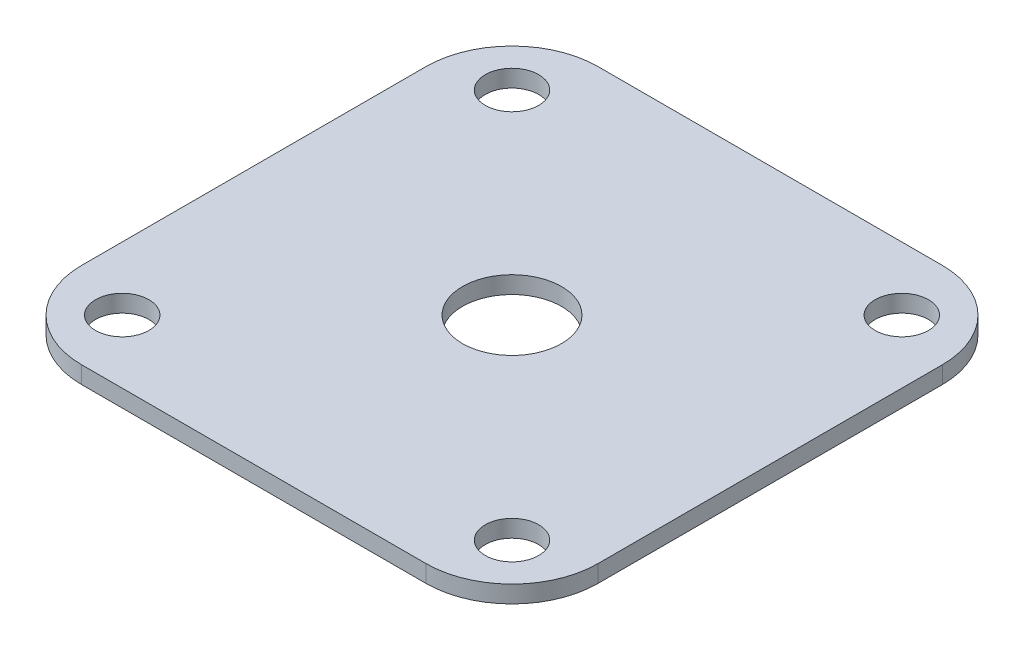
ISO-10303-21;
HEADER;
FILE_DESCRIPTION(('STEP AP214'),'2;1');
FILE_NAME('part.step','',(''),(''),'','','');
FILE_SCHEMA(('AUTOMOTIVE_DESIGN { 1 0 10303 214 1 1 1 1 }'));
ENDSEC;
DATA;
#1=APPLICATION_CONTEXT('core data for automotive mechanical design processes');
#2=APPLICATION_PROTOCOL_DEFINITION('international standard','automotive_design',2000,#1);
#3=PRODUCT_CONTEXT('',#1,'mechanical');
#4=PRODUCT('Part','Part','',(#3));
#5=PRODUCT_RELATED_PRODUCT_CATEGORY('part','',(#4));
#6=PRODUCT_DEFINITION_FORMATION('','',#4);
#7=PRODUCT_DEFINITION_CONTEXT('part definition',#1,'design');
#8=PRODUCT_DEFINITION('design','',#6,#7);
#9=PRODUCT_DEFINITION_SHAPE('','',#8);
#10=(LENGTH_UNIT() NAMED_UNIT(*) SI_UNIT(.MILLI.,.METRE.));
#11=(NAMED_UNIT(*) PLANE_ANGLE_UNIT() SI_UNIT($,.RADIAN.));
#12=(NAMED_UNIT(*) SI_UNIT($,.STERADIAN.) SOLID_ANGLE_UNIT());
#13=UNCERTAINTY_MEASURE_WITH_UNIT(LENGTH_MEASURE(1.E-05),#10,'distance_accuracy_value','');
#14=(GEOMETRIC_REPRESENTATION_CONTEXT(3) GLOBAL_UNCERTAINTY_ASSIGNED_CONTEXT((#13)) GLOBAL_UNIT_ASSIGNED_CONTEXT((#10,
#11,#12)) REPRESENTATION_CONTEXT('',''));
#15=CARTESIAN_POINT('',(0.,0.,0.));
#16=DIRECTION('',(0.,0.,1.));
#17=DIRECTION('',(1.,0.,0.));
#18=AXIS2_PLACEMENT_3D('',#15,#16,#17);
#19=CARTESIAN_POINT('',(20.,2.,20.));
#20=DIRECTION('',(0.,1.,0.));
#21=DIRECTION('',(0.,0.,1.));
#22=AXIS2_PLACEMENT_3D('',#19,#20,#21);
#23=PLANE('',#22);
#24=CARTESIAN_POINT('',(0.,2.,0.));
#25=DIRECTION('',(0.,1.,0.));
#26=DIRECTION('',(0.,0.,1.));
#27=AXIS2_PLACEMENT_3D('',#24,#25,#26);
#28=CIRCLE('',#27,5.75);
#29=CARTESIAN_POINT('',(0.,2.,5.75));
#30=VERTEX_POINT('',#29);
#31=EDGE_CURVE('E203',#30,#30,#28,.T.);
#32=ORIENTED_EDGE('',*,*,#31,.F.);
#33=EDGE_LOOP('',(#32));
#34=FACE_BOUND('',#33,.T.);
#35=CARTESIAN_POINT('',(22.6442307692308,2.,22.6442307692308));
#36=DIRECTION('',(0.,1.,0.));
#37=DIRECTION('',(0.,0.,1.));
#38=AXIS2_PLACEMENT_3D('',#35,#36,#37);
#39=CIRCLE('',#38,3.1);
#40=CARTESIAN_POINT('',(22.6442307692308,2.,25.7442307692308));
#41=VERTEX_POINT('',#40);
#42=EDGE_CURVE('E188',#41,#41,#39,.T.);
#43=ORIENTED_EDGE('',*,*,#42,.F.);
#44=EDGE_LOOP('',(#43));
#45=FACE_BOUND('',#44,.T.);
#46=CARTESIAN_POINT('',(-22.6442307692308,2.,-22.6442307692308));
#47=DIRECTION('',(0.,1.,0.));
#48=DIRECTION('',(0.,0.,1.));
#49=AXIS2_PLACEMENT_3D('',#46,#47,#48);
#50=CIRCLE('',#49,3.1);
#51=CARTESIAN_POINT('',(-22.6442307692308,2.,-19.5442307692308));
#52=VERTEX_POINT('',#51);
#53=EDGE_CURVE('E134',#52,#52,#50,.T.);
#54=ORIENTED_EDGE('',*,*,#53,.F.);
#55=EDGE_LOOP('',(#54));
#56=FACE_BOUND('',#55,.T.);
#57=CARTESIAN_POINT('',(20.,2.,20.));
#58=DIRECTION('',(0.,1.,0.));
#59=DIRECTION('',(0.,0.,1.));
#60=AXIS2_PLACEMENT_3D('',#57,#58,#59);
#61=CIRCLE('',#60,10.);
#62=CARTESIAN_POINT('',(19.9999999999999,2.,30.));
#63=VERTEX_POINT('',#62);
#64=CARTESIAN_POINT('',(30.,2.,19.9999999999999));
#65=VERTEX_POINT('',#64);
#66=EDGE_CURVE('E145',#63,#65,#61,.T.);
#67=ORIENTED_EDGE('',*,*,#66,.T.);
#68=DIRECTION('',(0.,0.,-1.));
#69=VECTOR('',#68,1.);
#70=CARTESIAN_POINT('',(30.,2.,19.9999999999999));
#71=LINE('',#70,#69);
#72=CARTESIAN_POINT('',(30.,2.,-19.9999999999999));
#73=VERTEX_POINT('',#72);
#74=EDGE_CURVE('E93',#65,#73,#71,.T.);
#75=ORIENTED_EDGE('',*,*,#74,.T.);
#76=CARTESIAN_POINT('',(20.,2.,-20.));
#77=DIRECTION('',(0.,1.,0.));
#78=DIRECTION('',(0.,0.,-1.));
#79=AXIS2_PLACEMENT_3D('',#76,#77,#78);
#80=CIRCLE('',#79,10.);
#81=CARTESIAN_POINT('',(19.9999999999999,2.,-30.));
#82=VERTEX_POINT('',#81);
#83=EDGE_CURVE('E160',#73,#82,#80,.T.);
#84=ORIENTED_EDGE('',*,*,#83,.T.);
#85=DIRECTION('',(-1.,0.,0.));
#86=VECTOR('',#85,1.);
#87=CARTESIAN_POINT('',(-19.9999999999999,2.,-30.));
#88=LINE('',#87,#86);
#89=CARTESIAN_POINT('',(-20.,2.,-30.));
#90=VERTEX_POINT('',#89);
#91=EDGE_CURVE('E173',#82,#90,#88,.T.);
#92=ORIENTED_EDGE('',*,*,#91,.T.);
#93=CARTESIAN_POINT('',(-20.,2.,-20.));
#94=DIRECTION('',(0.,1.,0.));
#95=DIRECTION('',(0.,0.,-1.));
#96=AXIS2_PLACEMENT_3D('',#93,#94,#95);
#97=CIRCLE('',#96,10.);
#98=CARTESIAN_POINT('',(-30.,2.,-19.9999999999999));
#99=VERTEX_POINT('',#98);
#100=EDGE_CURVE('E112',#90,#99,#97,.T.);
#101=ORIENTED_EDGE('',*,*,#100,.T.);
#102=DIRECTION('',(0.,0.,1.));
#103=VECTOR('',#102,1.);
#104=CARTESIAN_POINT('',(-30.,2.,19.9999999999999));
#105=LINE('',#104,#103);
#106=CARTESIAN_POINT('',(-30.,2.,19.9999999999999));
#107=VERTEX_POINT('',#106);
#108=EDGE_CURVE('E106',#99,#107,#105,.T.);
#109=ORIENTED_EDGE('',*,*,#108,.T.);
#110=CARTESIAN_POINT('',(-20.,2.,20.));
#111=DIRECTION('',(0.,1.,0.));
#112=DIRECTION('',(0.,0.,-1.));
#113=AXIS2_PLACEMENT_3D('',#110,#111,#112);
#114=CIRCLE('',#113,10.);
#115=CARTESIAN_POINT('',(-19.9999999999999,2.,30.));
#116=VERTEX_POINT('',#115);
#117=EDGE_CURVE('E110',#107,#116,#114,.T.);
#118=ORIENTED_EDGE('',*,*,#117,.T.);
#119=DIRECTION('',(1.,0.,0.));
#120=VECTOR('',#119,1.);
#121=CARTESIAN_POINT('',(-19.9999999999999,2.,30.));
#122=LINE('',#121,#120);
#123=EDGE_CURVE('E50',#116,#63,#122,.T.);
#124=ORIENTED_EDGE('',*,*,#123,.T.);
#125=EDGE_LOOP('',(#67,#75,#84,#92,#101,#109,#118,#124));
#126=FACE_BOUND('',#125,.T.);
#127=CARTESIAN_POINT('',(-22.6442307692308,2.,22.6442307692308));
#128=DIRECTION('',(0.,1.,0.));
#129=DIRECTION('',(0.,0.,1.));
#130=AXIS2_PLACEMENT_3D('',#127,#128,#129);
#131=CIRCLE('',#130,3.1);
#132=CARTESIAN_POINT('',(-22.6442307692308,2.,25.7442307692308));
#133=VERTEX_POINT('',#132);
#134=EDGE_CURVE('E182',#133,#133,#131,.T.);
#135=ORIENTED_EDGE('',*,*,#134,.F.);
#136=EDGE_LOOP('',(#135));
#137=FACE_BOUND('',#136,.T.);
#138=CARTESIAN_POINT('',(22.6442307692308,2.,-22.6442307692307));
#139=DIRECTION('',(0.,1.,0.));
#140=DIRECTION('',(0.,0.,1.));
#141=AXIS2_PLACEMENT_3D('',#138,#139,#140);
#142=CIRCLE('',#141,3.1);
#143=CARTESIAN_POINT('',(22.6442307692308,2.,-19.5442307692308));
#144=VERTEX_POINT('',#143);
#145=EDGE_CURVE('E194',#144,#144,#142,.T.);
#146=ORIENTED_EDGE('',*,*,#145,.F.);
#147=EDGE_LOOP('',(#146));
#148=FACE_BOUND('',#147,.T.);
#149=ADVANCED_FACE('F33',(#34,#45,#56,#126,#137,#148),#23,.T.);
#150=CARTESIAN_POINT('',(20.,0.,20.));
#151=DIRECTION('',(0.,1.,0.));
#152=DIRECTION('',(0.,0.,1.));
#153=AXIS2_PLACEMENT_3D('',#150,#151,#152);
#154=PLANE('',#153);
#155=CARTESIAN_POINT('',(0.,0.,0.));
#156=DIRECTION('',(0.,1.,0.));
#157=DIRECTION('',(0.,0.,1.));
#158=AXIS2_PLACEMENT_3D('',#155,#156,#157);
#159=CIRCLE('',#158,5.75);
#160=CARTESIAN_POINT('',(0.,0.,5.75));
#161=VERTEX_POINT('',#160);
#162=EDGE_CURVE('E200',#161,#161,#159,.T.);
#163=ORIENTED_EDGE('',*,*,#162,.T.);
#164=EDGE_LOOP('',(#163));
#165=FACE_BOUND('',#164,.T.);
#166=CARTESIAN_POINT('',(20.,0.,20.));
#167=DIRECTION('',(0.,1.,0.));
#168=DIRECTION('',(0.,0.,1.));
#169=AXIS2_PLACEMENT_3D('',#166,#167,#168);
#170=CIRCLE('',#169,10.);
#171=CARTESIAN_POINT('',(19.9999999999999,0.,30.));
#172=VERTEX_POINT('',#171);
#173=CARTESIAN_POINT('',(30.,0.,19.9999999999999));
#174=VERTEX_POINT('',#173);
#175=EDGE_CURVE('E130',#172,#174,#170,.T.);
#176=ORIENTED_EDGE('',*,*,#175,.F.);
#177=DIRECTION('',(1.,0.,0.));
#178=VECTOR('',#177,1.);
#179=CARTESIAN_POINT('',(-19.9999999999999,0.,30.));
#180=LINE('',#179,#178);
#181=CARTESIAN_POINT('',(-19.9999999999999,0.,30.));
#182=VERTEX_POINT('',#181);
#183=EDGE_CURVE('E85',#182,#172,#180,.T.);
#184=ORIENTED_EDGE('',*,*,#183,.F.);
#185=CARTESIAN_POINT('',(-20.,0.,20.));
#186=DIRECTION('',(0.,1.,0.));
#187=DIRECTION('',(0.,0.,-1.));
#188=AXIS2_PLACEMENT_3D('',#185,#186,#187);
#189=CIRCLE('',#188,10.);
#190=CARTESIAN_POINT('',(-30.,0.,19.9999999999999));
#191=VERTEX_POINT('',#190);
#192=EDGE_CURVE('E79',#191,#182,#189,.T.);
#193=ORIENTED_EDGE('',*,*,#192,.F.);
#194=DIRECTION('',(0.,0.,1.));
#195=VECTOR('',#194,1.);
#196=CARTESIAN_POINT('',(-30.,0.,19.9999999999999));
#197=LINE('',#196,#195);
#198=CARTESIAN_POINT('',(-30.,0.,-19.9999999999999));
#199=VERTEX_POINT('',#198);
#200=EDGE_CURVE('E120',#199,#191,#197,.T.);
#201=ORIENTED_EDGE('',*,*,#200,.F.);
#202=CARTESIAN_POINT('',(-20.,0.,-20.));
#203=DIRECTION('',(0.,1.,0.));
#204=DIRECTION('',(0.,0.,-1.));
#205=AXIS2_PLACEMENT_3D('',#202,#203,#204);
#206=CIRCLE('',#205,10.);
#207=CARTESIAN_POINT('',(-20.,0.,-30.));
#208=VERTEX_POINT('',#207);
#209=EDGE_CURVE('E140',#208,#199,#206,.T.);
#210=ORIENTED_EDGE('',*,*,#209,.F.);
#211=DIRECTION('',(-1.,0.,0.));
#212=VECTOR('',#211,1.);
#213=CARTESIAN_POINT('',(-19.9999999999999,0.,-30.));
#214=LINE('',#213,#212);
#215=CARTESIAN_POINT('',(19.9999999999999,0.,-30.));
#216=VERTEX_POINT('',#215);
#217=EDGE_CURVE('E138',#216,#208,#214,.T.);
#218=ORIENTED_EDGE('',*,*,#217,.F.);
#219=CARTESIAN_POINT('',(20.,0.,-20.));
#220=DIRECTION('',(0.,1.,0.));
#221=DIRECTION('',(0.,0.,-1.));
#222=AXIS2_PLACEMENT_3D('',#219,#220,#221);
#223=CIRCLE('',#222,10.);
#224=CARTESIAN_POINT('',(30.,0.,-19.9999999999999));
#225=VERTEX_POINT('',#224);
#226=EDGE_CURVE('E136',#225,#216,#223,.T.);
#227=ORIENTED_EDGE('',*,*,#226,.F.);
#228=DIRECTION('',(0.,0.,-1.));
#229=VECTOR('',#228,1.);
#230=CARTESIAN_POINT('',(30.,0.,19.9999999999999));
#231=LINE('',#230,#229);
#232=EDGE_CURVE('E133',#174,#225,#231,.T.);
#233=ORIENTED_EDGE('',*,*,#232,.F.);
#234=EDGE_LOOP('',(#176,#184,#193,#201,#210,#218,#227,#233));
#235=FACE_BOUND('',#234,.T.);
#236=CARTESIAN_POINT('',(-22.6442307692308,0.,-22.6442307692308));
#237=DIRECTION('',(0.,1.,0.));
#238=DIRECTION('',(0.,0.,1.));
#239=AXIS2_PLACEMENT_3D('',#236,#237,#238);
#240=CIRCLE('',#239,3.1);
#241=CARTESIAN_POINT('',(-22.6442307692308,0.,-19.5442307692308));
#242=VERTEX_POINT('',#241);
#243=EDGE_CURVE('E179',#242,#242,#240,.T.);
#244=ORIENTED_EDGE('',*,*,#243,.T.);
#245=EDGE_LOOP('',(#244));
#246=FACE_BOUND('',#245,.T.);
#247=CARTESIAN_POINT('',(-22.6442307692308,0.,22.6442307692308));
#248=DIRECTION('',(0.,1.,0.));
#249=DIRECTION('',(0.,0.,1.));
#250=AXIS2_PLACEMENT_3D('',#247,#248,#249);
#251=CIRCLE('',#250,3.1);
#252=CARTESIAN_POINT('',(-22.6442307692308,0.,25.7442307692308));
#253=VERTEX_POINT('',#252);
#254=EDGE_CURVE('E185',#253,#253,#251,.T.);
#255=ORIENTED_EDGE('',*,*,#254,.T.);
#256=EDGE_LOOP('',(#255));
#257=FACE_BOUND('',#256,.T.);
#258=CARTESIAN_POINT('',(22.6442307692308,0.,22.6442307692308));
#259=DIRECTION('',(0.,1.,0.));
#260=DIRECTION('',(0.,0.,1.));
#261=AXIS2_PLACEMENT_3D('',#258,#259,#260);
#262=CIRCLE('',#261,3.1);
#263=CARTESIAN_POINT('',(22.6442307692308,0.,25.7442307692308));
#264=VERTEX_POINT('',#263);
#265=EDGE_CURVE('E191',#264,#264,#262,.T.);
#266=ORIENTED_EDGE('',*,*,#265,.T.);
#267=EDGE_LOOP('',(#266));
#268=FACE_BOUND('',#267,.T.);
#269=CARTESIAN_POINT('',(22.6442307692308,0.,-22.6442307692307));
#270=DIRECTION('',(0.,1.,0.));
#271=DIRECTION('',(0.,0.,1.));
#272=AXIS2_PLACEMENT_3D('',#269,#270,#271);
#273=CIRCLE('',#272,3.1);
#274=CARTESIAN_POINT('',(22.6442307692308,0.,-19.5442307692308));
#275=VERTEX_POINT('',#274);
#276=EDGE_CURVE('E197',#275,#275,#273,.T.);
#277=ORIENTED_EDGE('',*,*,#276,.T.);
#278=EDGE_LOOP('',(#277));
#279=FACE_BOUND('',#278,.T.);
#280=ADVANCED_FACE('F164',(#165,#235,#246,#257,#268,#279),#154,.F.);
#281=CARTESIAN_POINT('',(20.,2.,20.));
#282=DIRECTION('',(0.,-1.,0.));
#283=DIRECTION('',(0.,0.,-1.));
#284=AXIS2_PLACEMENT_3D('',#281,#282,#283);
#285=CYLINDRICAL_SURFACE('',#284,10.);
#286=ORIENTED_EDGE('',*,*,#175,.T.);
#287=DIRECTION('',(0.,-1.,0.));
#288=VECTOR('',#287,1.);
#289=CARTESIAN_POINT('',(30.,2.,19.9999999999999));
#290=LINE('',#289,#288);
#291=EDGE_CURVE('E11',#65,#174,#290,.T.);
#292=ORIENTED_EDGE('',*,*,#291,.F.);
#293=ORIENTED_EDGE('',*,*,#66,.F.);
#294=DIRECTION('',(0.,-1.,0.));
#295=VECTOR('',#294,1.);
#296=CARTESIAN_POINT('',(19.9999999999999,2.,30.));
#297=LINE('',#296,#295);
#298=EDGE_CURVE('E126',#63,#172,#297,.T.);
#299=ORIENTED_EDGE('',*,*,#298,.T.);
#300=EDGE_LOOP('',(#286,#292,#293,#299));
#301=FACE_BOUND('',#300,.T.);
#302=ADVANCED_FACE('F35',(#301),#285,.T.);
#303=CARTESIAN_POINT('',(30.,2.,19.9999999999999));
#304=DIRECTION('',(-1.,0.,0.));
#305=DIRECTION('',(0.,0.,1.));
#306=AXIS2_PLACEMENT_3D('',#303,#304,#305);
#307=PLANE('',#306);
#308=ORIENTED_EDGE('',*,*,#232,.T.);
#309=DIRECTION('',(0.,-1.,0.));
#310=VECTOR('',#309,1.);
#311=CARTESIAN_POINT('',(30.,2.,-19.9999999999999));
#312=LINE('',#311,#310);
#313=EDGE_CURVE('E42',#73,#225,#312,.T.);
#314=ORIENTED_EDGE('',*,*,#313,.F.);
#315=ORIENTED_EDGE('',*,*,#74,.F.);
#316=ORIENTED_EDGE('',*,*,#291,.T.);
#317=EDGE_LOOP('',(#308,#314,#315,#316));
#318=FACE_BOUND('',#317,.T.);
#319=ADVANCED_FACE('F264',(#318),#307,.F.);
#320=CARTESIAN_POINT('',(20.,2.,-20.));
#321=DIRECTION('',(0.,-1.,0.));
#322=DIRECTION('',(0.,0.,-1.));
#323=AXIS2_PLACEMENT_3D('',#320,#321,#322);
#324=CYLINDRICAL_SURFACE('',#323,10.);
#325=ORIENTED_EDGE('',*,*,#226,.T.);
#326=DIRECTION('',(0.,-1.,0.));
#327=VECTOR('',#326,1.);
#328=CARTESIAN_POINT('',(19.9999999999999,2.,-30.));
#329=LINE('',#328,#327);
#330=EDGE_CURVE('E152',#82,#216,#329,.T.);
#331=ORIENTED_EDGE('',*,*,#330,.F.);
#332=ORIENTED_EDGE('',*,*,#83,.F.);
#333=ORIENTED_EDGE('',*,*,#313,.T.);
#334=EDGE_LOOP('',(#325,#331,#332,#333));
#335=FACE_BOUND('',#334,.T.);
#336=ADVANCED_FACE('F158',(#335),#324,.T.);
#337=CARTESIAN_POINT('',(-19.9999999999999,2.,-30.));
#338=DIRECTION('',(0.,0.,1.));
#339=DIRECTION('',(1.,0.,0.));
#340=AXIS2_PLACEMENT_3D('',#337,#338,#339);
#341=PLANE('',#340);
#342=ORIENTED_EDGE('',*,*,#217,.T.);
#343=DIRECTION('',(0.,-1.,0.));
#344=VECTOR('',#343,1.);
#345=CARTESIAN_POINT('',(-20.,2.,-30.));
#346=LINE('',#345,#344);
#347=EDGE_CURVE('E149',#90,#208,#346,.T.);
#348=ORIENTED_EDGE('',*,*,#347,.F.);
#349=ORIENTED_EDGE('',*,*,#91,.F.);
#350=ORIENTED_EDGE('',*,*,#330,.T.);
#351=EDGE_LOOP('',(#342,#348,#349,#350));
#352=FACE_BOUND('',#351,.T.);
#353=ADVANCED_FACE('F169',(#352),#341,.F.);
#354=CARTESIAN_POINT('',(-20.,2.,-20.));
#355=DIRECTION('',(0.,-1.,0.));
#356=DIRECTION('',(0.,0.,-1.));
#357=AXIS2_PLACEMENT_3D('',#354,#355,#356);
#358=CYLINDRICAL_SURFACE('',#357,10.);
#359=ORIENTED_EDGE('',*,*,#209,.T.);
#360=DIRECTION('',(0.,-1.,0.));
#361=VECTOR('',#360,1.);
#362=CARTESIAN_POINT('',(-30.,2.,-19.9999999999999));
#363=LINE('',#362,#361);
#364=EDGE_CURVE('E121',#99,#199,#363,.T.);
#365=ORIENTED_EDGE('',*,*,#364,.F.);
#366=ORIENTED_EDGE('',*,*,#100,.F.);
#367=ORIENTED_EDGE('',*,*,#347,.T.);
#368=EDGE_LOOP('',(#359,#365,#366,#367));
#369=FACE_BOUND('',#368,.T.);
#370=ADVANCED_FACE('F172',(#369),#358,.T.);
#371=CARTESIAN_POINT('',(-30.,2.,19.9999999999999));
#372=DIRECTION('',(1.,0.,0.));
#373=DIRECTION('',(0.,0.,-1.));
#374=AXIS2_PLACEMENT_3D('',#371,#372,#373);
#375=PLANE('',#374);
#376=ORIENTED_EDGE('',*,*,#200,.T.);
#377=DIRECTION('',(0.,-1.,0.));
#378=VECTOR('',#377,1.);
#379=CARTESIAN_POINT('',(-30.,2.,19.9999999999999));
#380=LINE('',#379,#378);
#381=EDGE_CURVE('E117',#107,#191,#380,.T.);
#382=ORIENTED_EDGE('',*,*,#381,.F.);
#383=ORIENTED_EDGE('',*,*,#108,.F.);
#384=ORIENTED_EDGE('',*,*,#364,.T.);
#385=EDGE_LOOP('',(#376,#382,#383,#384));
#386=FACE_BOUND('',#385,.T.);
#387=ADVANCED_FACE('F118',(#386),#375,.F.);
#388=CARTESIAN_POINT('',(-20.,2.,20.));
#389=DIRECTION('',(0.,-1.,0.));
#390=DIRECTION('',(0.,0.,-1.));
#391=AXIS2_PLACEMENT_3D('',#388,#389,#390);
#392=CYLINDRICAL_SURFACE('',#391,10.);
#393=ORIENTED_EDGE('',*,*,#192,.T.);
#394=DIRECTION('',(0.,-1.,0.));
#395=VECTOR('',#394,1.);
#396=CARTESIAN_POINT('',(-19.9999999999999,2.,30.));
#397=LINE('',#396,#395);
#398=EDGE_CURVE('E122',#116,#182,#397,.T.);
#399=ORIENTED_EDGE('',*,*,#398,.F.);
#400=ORIENTED_EDGE('',*,*,#117,.F.);
#401=ORIENTED_EDGE('',*,*,#381,.T.);
#402=EDGE_LOOP('',(#393,#399,#400,#401));
#403=FACE_BOUND('',#402,.T.);
#404=ADVANCED_FACE('F124',(#403),#392,.T.);
#405=CARTESIAN_POINT('',(-19.9999999999999,2.,30.));
#406=DIRECTION('',(0.,0.,-1.));
#407=DIRECTION('',(-1.,0.,0.));
#408=AXIS2_PLACEMENT_3D('',#405,#406,#407);
#409=PLANE('',#408);
#410=ORIENTED_EDGE('',*,*,#183,.T.);
#411=ORIENTED_EDGE('',*,*,#298,.F.);
#412=ORIENTED_EDGE('',*,*,#123,.F.);
#413=ORIENTED_EDGE('',*,*,#398,.T.);
#414=EDGE_LOOP('',(#410,#411,#412,#413));
#415=FACE_BOUND('',#414,.T.);
#416=ADVANCED_FACE('F228',(#415),#409,.F.);
#417=CARTESIAN_POINT('',(-22.6442307692308,2.,-22.6442307692308));
#418=DIRECTION('',(0.,-1.,0.));
#419=DIRECTION('',(0.,0.,-1.));
#420=AXIS2_PLACEMENT_3D('',#417,#418,#419);
#421=CYLINDRICAL_SURFACE('',#420,3.1);
#422=ORIENTED_EDGE('',*,*,#53,.T.);
#423=EDGE_LOOP('',(#422));
#424=FACE_BOUND('',#423,.T.);
#425=ORIENTED_EDGE('',*,*,#243,.F.);
#426=EDGE_LOOP('',(#425));
#427=FACE_BOUND('',#426,.T.);
#428=ADVANCED_FACE('F224',(#424,#427),#421,.F.);
#429=CARTESIAN_POINT('',(-22.6442307692308,2.,22.6442307692308));
#430=DIRECTION('',(0.,-1.,0.));
#431=DIRECTION('',(0.,0.,-1.));
#432=AXIS2_PLACEMENT_3D('',#429,#430,#431);
#433=CYLINDRICAL_SURFACE('',#432,3.1);
#434=ORIENTED_EDGE('',*,*,#134,.T.);
#435=EDGE_LOOP('',(#434));
#436=FACE_BOUND('',#435,.T.);
#437=ORIENTED_EDGE('',*,*,#254,.F.);
#438=EDGE_LOOP('',(#437));
#439=FACE_BOUND('',#438,.T.);
#440=ADVANCED_FACE('F227',(#436,#439),#433,.F.);
#441=CARTESIAN_POINT('',(22.6442307692308,2.,22.6442307692308));
#442=DIRECTION('',(0.,-1.,0.));
#443=DIRECTION('',(0.,0.,-1.));
#444=AXIS2_PLACEMENT_3D('',#441,#442,#443);
#445=CYLINDRICAL_SURFACE('',#444,3.1);
#446=ORIENTED_EDGE('',*,*,#42,.T.);
#447=EDGE_LOOP('',(#446));
#448=FACE_BOUND('',#447,.T.);
#449=ORIENTED_EDGE('',*,*,#265,.F.);
#450=EDGE_LOOP('',(#449));
#451=FACE_BOUND('',#450,.T.);
#452=ADVANCED_FACE('F241',(#448,#451),#445,.F.);
#453=CARTESIAN_POINT('',(22.6442307692308,2.,-22.6442307692307));
#454=DIRECTION('',(0.,-1.,0.));
#455=DIRECTION('',(0.,0.,-1.));
#456=AXIS2_PLACEMENT_3D('',#453,#454,#455);
#457=CYLINDRICAL_SURFACE('',#456,3.1);
#458=ORIENTED_EDGE('',*,*,#145,.T.);
#459=EDGE_LOOP('',(#458));
#460=FACE_BOUND('',#459,.T.);
#461=ORIENTED_EDGE('',*,*,#276,.F.);
#462=EDGE_LOOP('',(#461));
#463=FACE_BOUND('',#462,.T.);
#464=ADVANCED_FACE('F213',(#460,#463),#457,.F.);
#465=CARTESIAN_POINT('',(0.,0.,0.));
#466=DIRECTION('',(0.,1.,0.));
#467=DIRECTION('',(0.,0.,1.));
#468=AXIS2_PLACEMENT_3D('',#465,#466,#467);
#469=CYLINDRICAL_SURFACE('',#468,5.75);
#470=ORIENTED_EDGE('',*,*,#162,.F.);
#471=EDGE_LOOP('',(#470));
#472=FACE_BOUND('',#471,.T.);
#473=ORIENTED_EDGE('',*,*,#31,.T.);
#474=EDGE_LOOP('',(#473));
#475=FACE_BOUND('',#474,.T.);
#476=ADVANCED_FACE('F210',(#472,#475),#469,.F.);
#477=CLOSED_SHELL('',(#149,#280,#302,#319,#336,#353,#370,#387,#404,#416,#428,#440,#452,#464,#476));
#478=MANIFOLD_SOLID_BREP('B2',#477);
#479=ADVANCED_BREP_SHAPE_REPRESENTATION('',(#18,#478),#14);
#480=SHAPE_DEFINITION_REPRESENTATION(#9,#479);
ENDSEC;
END-ISO-10303-21;
